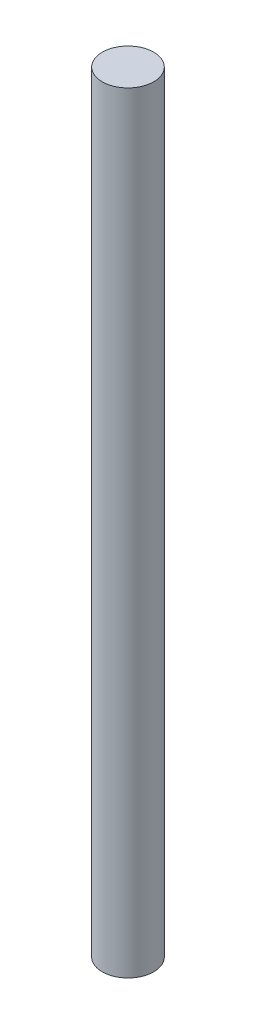
ISO-10303-21;
HEADER;
FILE_DESCRIPTION(('STEP AP214'),'2;1');
FILE_NAME('part.step','',(''),(''),'','','');
FILE_SCHEMA(('AUTOMOTIVE_DESIGN { 1 0 10303 214 1 1 1 1 }'));
ENDSEC;
DATA;
#1=APPLICATION_CONTEXT('core data for automotive mechanical design processes');
#2=APPLICATION_PROTOCOL_DEFINITION('international standard','automotive_design',2000,#1);
#3=PRODUCT_CONTEXT('',#1,'mechanical');
#4=PRODUCT('Part','Part','',(#3));
#5=PRODUCT_RELATED_PRODUCT_CATEGORY('part','',(#4));
#6=PRODUCT_DEFINITION_FORMATION('','',#4);
#7=PRODUCT_DEFINITION_CONTEXT('part definition',#1,'design');
#8=PRODUCT_DEFINITION('design','',#6,#7);
#9=PRODUCT_DEFINITION_SHAPE('','',#8);
#10=(LENGTH_UNIT() NAMED_UNIT(*) SI_UNIT(.MILLI.,.METRE.));
#11=(NAMED_UNIT(*) PLANE_ANGLE_UNIT() SI_UNIT($,.RADIAN.));
#12=(NAMED_UNIT(*) SI_UNIT($,.STERADIAN.) SOLID_ANGLE_UNIT());
#13=UNCERTAINTY_MEASURE_WITH_UNIT(LENGTH_MEASURE(1.E-05),#10,'distance_accuracy_value','');
#14=(GEOMETRIC_REPRESENTATION_CONTEXT(3) GLOBAL_UNCERTAINTY_ASSIGNED_CONTEXT((#13)) GLOBAL_UNIT_ASSIGNED_CONTEXT((#10,
#11,#12)) REPRESENTATION_CONTEXT('',''));
#15=CARTESIAN_POINT('',(0.,0.,0.));
#16=DIRECTION('',(0.,0.,1.));
#17=DIRECTION('',(1.,0.,0.));
#18=AXIS2_PLACEMENT_3D('',#15,#16,#17);
#19=CARTESIAN_POINT('',(0.,75.,0.));
#20=DIRECTION('',(0.,-1.,0.));
#21=DIRECTION('',(0.,0.,-1.));
#22=AXIS2_PLACEMENT_3D('',#19,#20,#21);
#23=CYLINDRICAL_SURFACE('',#22,2.5);
#24=CARTESIAN_POINT('',(0.,75.,0.));
#25=DIRECTION('',(0.,1.,0.));
#26=DIRECTION('',(0.,0.,1.));
#27=AXIS2_PLACEMENT_3D('',#24,#25,#26);
#28=CIRCLE('',#27,2.5);
#29=CARTESIAN_POINT('',(0.,75.,2.5));
#30=VERTEX_POINT('',#29);
#31=EDGE_CURVE('E10',#30,#30,#28,.T.);
#32=ORIENTED_EDGE('',*,*,#31,.F.);
#33=EDGE_LOOP('',(#32));
#34=FACE_BOUND('',#33,.T.);
#35=CARTESIAN_POINT('',(0.,0.,0.));
#36=DIRECTION('',(0.,1.,0.));
#37=DIRECTION('',(0.,0.,1.));
#38=AXIS2_PLACEMENT_3D('',#35,#36,#37);
#39=CIRCLE('',#38,2.5);
#40=CARTESIAN_POINT('',(0.,0.,2.5));
#41=VERTEX_POINT('',#40);
#42=EDGE_CURVE('E36',#41,#41,#39,.T.);
#43=ORIENTED_EDGE('',*,*,#42,.T.);
#44=EDGE_LOOP('',(#43));
#45=FACE_BOUND('',#44,.T.);
#46=ADVANCED_FACE('F33',(#34,#45),#23,.T.);
#47=CARTESIAN_POINT('',(0.,75.,0.));
#48=DIRECTION('',(0.,1.,0.));
#49=DIRECTION('',(0.,0.,1.));
#50=AXIS2_PLACEMENT_3D('',#47,#48,#49);
#51=PLANE('',#50);
#52=ORIENTED_EDGE('',*,*,#31,.T.);
#53=EDGE_LOOP('',(#52));
#54=FACE_BOUND('',#53,.T.);
#55=ADVANCED_FACE('F49',(#54),#51,.T.);
#56=CARTESIAN_POINT('',(0.,0.,0.));
#57=DIRECTION('',(0.,1.,0.));
#58=DIRECTION('',(0.,0.,1.));
#59=AXIS2_PLACEMENT_3D('',#56,#57,#58);
#60=PLANE('',#59);
#61=ORIENTED_EDGE('',*,*,#42,.F.);
#62=EDGE_LOOP('',(#61));
#63=FACE_BOUND('',#62,.T.);
#64=ADVANCED_FACE('F47',(#63),#60,.F.);
#65=CLOSED_SHELL('',(#46,#55,#64));
#66=MANIFOLD_SOLID_BREP('B2',#65);
#67=ADVANCED_BREP_SHAPE_REPRESENTATION('',(#18,#66),#14);
#68=SHAPE_DEFINITION_REPRESENTATION(#9,#67);
ENDSEC;
END-ISO-10303-21;
